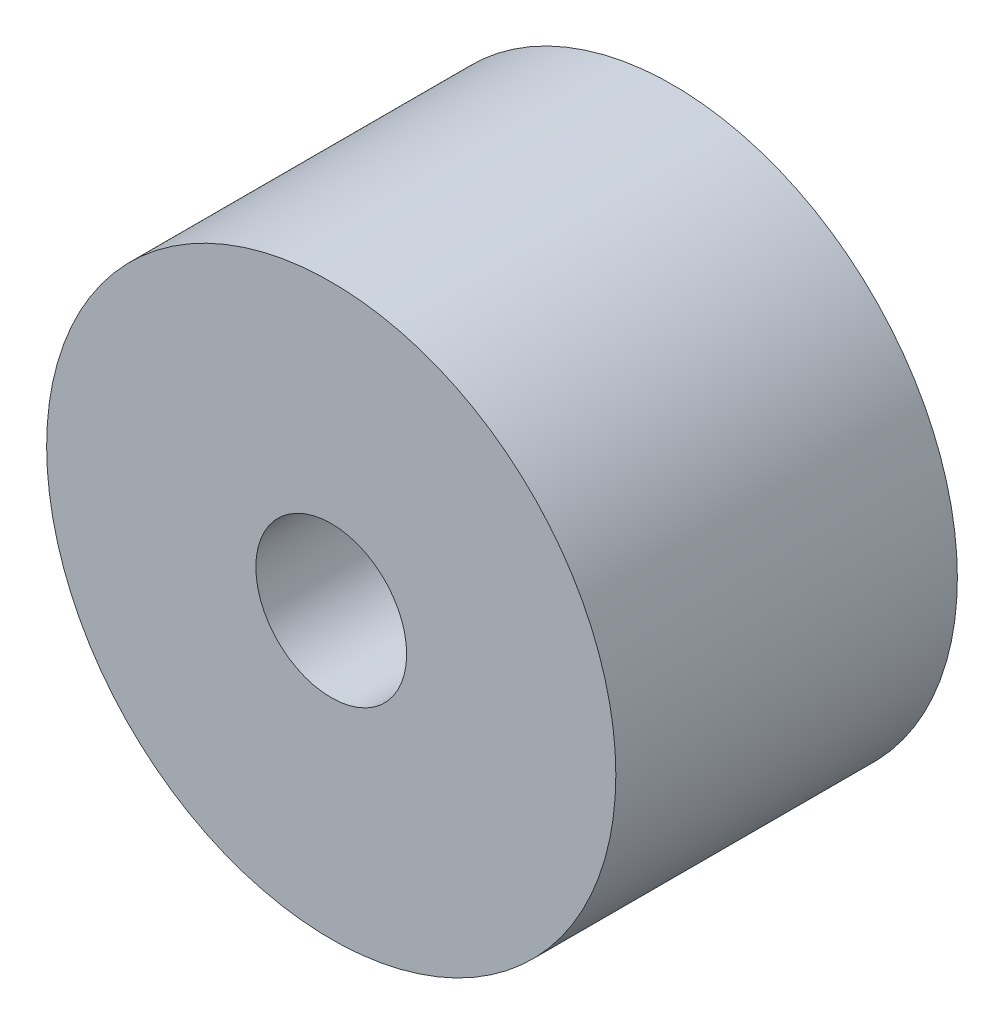
ISO-10303-21;
HEADER;
FILE_DESCRIPTION(('STEP AP214'),'2;1');
FILE_NAME('part.step','',(''),(''),'','','');
FILE_SCHEMA(('AUTOMOTIVE_DESIGN { 1 0 10303 214 1 1 1 1 }'));
ENDSEC;
DATA;
#1=APPLICATION_CONTEXT('core data for automotive mechanical design processes');
#2=APPLICATION_PROTOCOL_DEFINITION('international standard','automotive_design',2000,#1);
#3=PRODUCT_CONTEXT('',#1,'mechanical');
#4=PRODUCT('Part','Part','',(#3));
#5=PRODUCT_RELATED_PRODUCT_CATEGORY('part','',(#4));
#6=PRODUCT_DEFINITION_FORMATION('','',#4);
#7=PRODUCT_DEFINITION_CONTEXT('part definition',#1,'design');
#8=PRODUCT_DEFINITION('design','',#6,#7);
#9=PRODUCT_DEFINITION_SHAPE('','',#8);
#10=(LENGTH_UNIT() NAMED_UNIT(*) SI_UNIT(.MILLI.,.METRE.));
#11=(NAMED_UNIT(*) PLANE_ANGLE_UNIT() SI_UNIT($,.RADIAN.));
#12=(NAMED_UNIT(*) SI_UNIT($,.STERADIAN.) SOLID_ANGLE_UNIT());
#13=UNCERTAINTY_MEASURE_WITH_UNIT(LENGTH_MEASURE(1.E-05),#10,'distance_accuracy_value','');
#14=(GEOMETRIC_REPRESENTATION_CONTEXT(3) GLOBAL_UNCERTAINTY_ASSIGNED_CONTEXT((#13)) GLOBAL_UNIT_ASSIGNED_CONTEXT((#10,
#11,#12)) REPRESENTATION_CONTEXT('',''));
#15=CARTESIAN_POINT('',(0.,0.,0.));
#16=DIRECTION('',(0.,0.,1.));
#17=DIRECTION('',(1.,0.,0.));
#18=AXIS2_PLACEMENT_3D('',#15,#16,#17);
#19=CARTESIAN_POINT('',(0.,0.,12.));
#20=DIRECTION('',(0.,0.,-1.));
#21=DIRECTION('',(-1.,0.,0.));
#22=AXIS2_PLACEMENT_3D('',#19,#20,#21);
#23=CYLINDRICAL_SURFACE('',#22,10.);
#24=CARTESIAN_POINT('',(0.,0.,12.));
#25=DIRECTION('',(0.,0.,1.));
#26=DIRECTION('',(1.,0.,0.));
#27=AXIS2_PLACEMENT_3D('',#24,#25,#26);
#28=CIRCLE('',#27,10.);
#29=CARTESIAN_POINT('',(10.,0.,12.));
#30=VERTEX_POINT('',#29);
#31=EDGE_CURVE('E10',#30,#30,#28,.T.);
#32=ORIENTED_EDGE('',*,*,#31,.F.);
#33=EDGE_LOOP('',(#32));
#34=FACE_BOUND('',#33,.T.);
#35=CARTESIAN_POINT('',(0.,0.,0.));
#36=DIRECTION('',(0.,0.,1.));
#37=DIRECTION('',(1.,0.,0.));
#38=AXIS2_PLACEMENT_3D('',#35,#36,#37);
#39=CIRCLE('',#38,10.);
#40=CARTESIAN_POINT('',(10.,0.,0.));
#41=VERTEX_POINT('',#40);
#42=EDGE_CURVE('E34',#41,#41,#39,.T.);
#43=ORIENTED_EDGE('',*,*,#42,.T.);
#44=EDGE_LOOP('',(#43));
#45=FACE_BOUND('',#44,.T.);
#46=ADVANCED_FACE('F31',(#34,#45),#23,.T.);
#47=CARTESIAN_POINT('',(0.,0.,12.));
#48=DIRECTION('',(0.,0.,1.));
#49=DIRECTION('',(1.,0.,0.));
#50=AXIS2_PLACEMENT_3D('',#47,#48,#49);
#51=PLANE('',#50);
#52=CARTESIAN_POINT('',(0.,0.,12.));
#53=DIRECTION('',(0.,0.,1.));
#54=DIRECTION('',(1.,0.,0.));
#55=AXIS2_PLACEMENT_3D('',#52,#53,#54);
#56=CIRCLE('',#55,2.65);
#57=CARTESIAN_POINT('',(2.65,0.,12.));
#58=VERTEX_POINT('',#57);
#59=EDGE_CURVE('E41',#58,#58,#56,.F.);
#60=ORIENTED_EDGE('',*,*,#59,.T.);
#61=EDGE_LOOP('',(#60));
#62=FACE_BOUND('',#61,.T.);
#63=ORIENTED_EDGE('',*,*,#31,.T.);
#64=EDGE_LOOP('',(#63));
#65=FACE_BOUND('',#64,.T.);
#66=ADVANCED_FACE('F55',(#62,#65),#51,.T.);
#67=CARTESIAN_POINT('',(0.,0.,0.));
#68=DIRECTION('',(0.,0.,1.));
#69=DIRECTION('',(1.,0.,0.));
#70=AXIS2_PLACEMENT_3D('',#67,#68,#69);
#71=PLANE('',#70);
#72=CARTESIAN_POINT('',(0.,0.,0.));
#73=DIRECTION('',(0.,0.,-1.));
#74=DIRECTION('',(-1.,0.,0.));
#75=AXIS2_PLACEMENT_3D('',#72,#73,#74);
#76=CIRCLE('',#75,2.65);
#77=CARTESIAN_POINT('',(-2.65,0.,0.));
#78=VERTEX_POINT('',#77);
#79=EDGE_CURVE('E45',#78,#78,#76,.T.);
#80=ORIENTED_EDGE('',*,*,#79,.F.);
#81=EDGE_LOOP('',(#80));
#82=FACE_BOUND('',#81,.T.);
#83=ORIENTED_EDGE('',*,*,#42,.F.);
#84=EDGE_LOOP('',(#83));
#85=FACE_BOUND('',#84,.T.);
#86=ADVANCED_FACE('F52',(#82,#85),#71,.F.);
#87=CARTESIAN_POINT('',(0.,0.,19.4953318805774));
#88=DIRECTION('',(0.,0.,-1.));
#89=DIRECTION('',(-1.,0.,0.));
#90=AXIS2_PLACEMENT_3D('',#87,#88,#89);
#91=CYLINDRICAL_SURFACE('',#90,2.65);
#92=ORIENTED_EDGE('',*,*,#79,.T.);
#93=EDGE_LOOP('',(#92));
#94=FACE_BOUND('',#93,.T.);
#95=ORIENTED_EDGE('',*,*,#59,.F.);
#96=EDGE_LOOP('',(#95));
#97=FACE_BOUND('',#96,.T.);
#98=ADVANCED_FACE('F49',(#94,#97),#91,.F.);
#99=CLOSED_SHELL('',(#46,#66,#86,#98));
#100=MANIFOLD_SOLID_BREP('B2',#99);
#101=ADVANCED_BREP_SHAPE_REPRESENTATION('',(#18,#100),#14);
#102=SHAPE_DEFINITION_REPRESENTATION(#9,#101);
ENDSEC;
END-ISO-10303-21;
